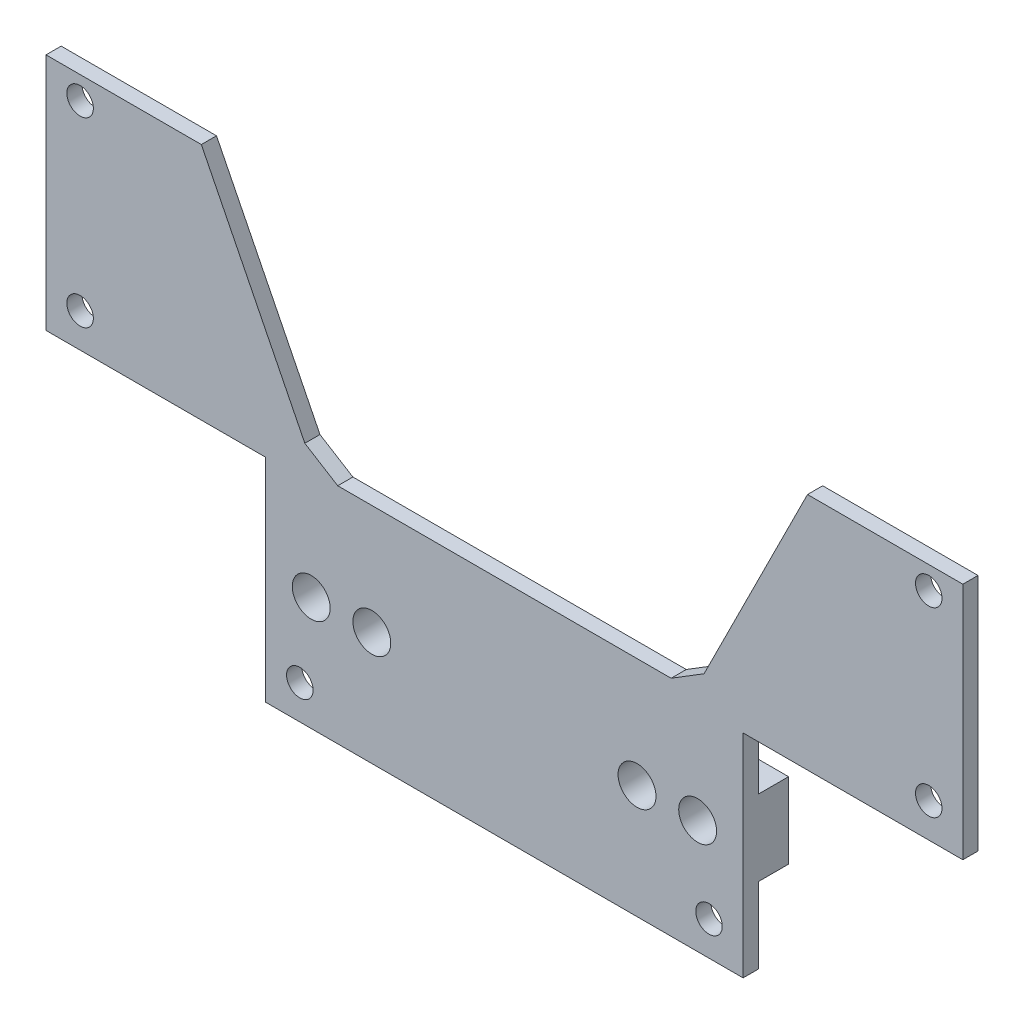
ISO-10303-21;
HEADER;
FILE_DESCRIPTION(('STEP AP214'),'2;1');
FILE_NAME('part.step','',(''),(''),'','','');
FILE_SCHEMA(('AUTOMOTIVE_DESIGN { 1 0 10303 214 1 1 1 1 }'));
ENDSEC;
DATA;
#1=APPLICATION_CONTEXT('core data for automotive mechanical design processes');
#2=APPLICATION_PROTOCOL_DEFINITION('international standard','automotive_design',2000,#1);
#3=PRODUCT_CONTEXT('',#1,'mechanical');
#4=PRODUCT('Part','Part','',(#3));
#5=PRODUCT_RELATED_PRODUCT_CATEGORY('part','',(#4));
#6=PRODUCT_DEFINITION_FORMATION('','',#4);
#7=PRODUCT_DEFINITION_CONTEXT('part definition',#1,'design');
#8=PRODUCT_DEFINITION('design','',#6,#7);
#9=PRODUCT_DEFINITION_SHAPE('','',#8);
#10=(LENGTH_UNIT() NAMED_UNIT(*) SI_UNIT(.MILLI.,.METRE.));
#11=(NAMED_UNIT(*) PLANE_ANGLE_UNIT() SI_UNIT($,.RADIAN.));
#12=(NAMED_UNIT(*) SI_UNIT($,.STERADIAN.) SOLID_ANGLE_UNIT());
#13=UNCERTAINTY_MEASURE_WITH_UNIT(LENGTH_MEASURE(1.E-05),#10,'distance_accuracy_value','');
#14=(GEOMETRIC_REPRESENTATION_CONTEXT(3) GLOBAL_UNCERTAINTY_ASSIGNED_CONTEXT((#13)) GLOBAL_UNIT_ASSIGNED_CONTEXT((#10,
#11,#12)) REPRESENTATION_CONTEXT('',''));
#15=CARTESIAN_POINT('',(0.,0.,0.));
#16=DIRECTION('',(0.,0.,1.));
#17=DIRECTION('',(1.,0.,0.));
#18=AXIS2_PLACEMENT_3D('',#15,#16,#17);
#19=CARTESIAN_POINT('',(60.5,59.5,1.99999999999995));
#20=DIRECTION('',(0.,-1.,0.));
#21=DIRECTION('',(0.,0.,-1.));
#22=AXIS2_PLACEMENT_3D('',#19,#20,#21);
#23=PLANE('',#22);
#24=DIRECTION('',(-1.,0.,0.));
#25=VECTOR('',#24,1.);
#26=CARTESIAN_POINT('',(60.5,59.5,-1.11022302462516E-13));
#27=LINE('',#26,#25);
#28=CARTESIAN_POINT('',(60.5,59.5,-1.11022302462516E-13));
#29=VERTEX_POINT('',#28);
#30=CARTESIAN_POINT('',(40.,59.5,-1.11022302462516E-13));
#31=VERTEX_POINT('',#30);
#32=EDGE_CURVE('E183',#29,#31,#27,.T.);
#33=ORIENTED_EDGE('',*,*,#32,.T.);
#34=DIRECTION('',(0.,0.,1.));
#35=VECTOR('',#34,1.);
#36=CARTESIAN_POINT('',(40.,59.5,-8.00000000000005));
#37=LINE('',#36,#35);
#38=CARTESIAN_POINT('',(40.,59.5,1.99999999999995));
#39=VERTEX_POINT('',#38);
#40=EDGE_CURVE('E166',#31,#39,#37,.T.);
#41=ORIENTED_EDGE('',*,*,#40,.T.);
#42=DIRECTION('',(-1.,0.,0.));
#43=VECTOR('',#42,1.);
#44=CARTESIAN_POINT('',(60.5,59.5,1.99999999999995));
#45=LINE('',#44,#43);
#46=CARTESIAN_POINT('',(60.5,59.5,1.99999999999995));
#47=VERTEX_POINT('',#46);
#48=EDGE_CURVE('E181',#47,#39,#45,.T.);
#49=ORIENTED_EDGE('',*,*,#48,.F.);
#50=DIRECTION('',(0.,0.,-1.));
#51=VECTOR('',#50,1.);
#52=CARTESIAN_POINT('',(60.5,59.5,1.99999999999995));
#53=LINE('',#52,#51);
#54=EDGE_CURVE('E212',#47,#29,#53,.T.);
#55=ORIENTED_EDGE('',*,*,#54,.T.);
#56=EDGE_LOOP('',(#33,#41,#49,#55));
#57=FACE_BOUND('',#56,.T.);
#58=ADVANCED_FACE('F39',(#57),#23,.F.);
#59=CARTESIAN_POINT('',(0.,0.,0.));
#60=DIRECTION('',(0.,0.,-1.));
#61=DIRECTION('',(-1.,0.,0.));
#62=AXIS2_PLACEMENT_3D('',#59,#60,#61);
#63=PLANE('',#62);
#64=CARTESIAN_POINT('',(27.,4.50000000000002,0.));
#65=DIRECTION('',(0.,0.,-1.));
#66=DIRECTION('',(-1.,0.,0.));
#67=AXIS2_PLACEMENT_3D('',#64,#65,#66);
#68=CIRCLE('',#67,1.75);
#69=CARTESIAN_POINT('',(25.25,4.50000000000002,0.));
#70=VERTEX_POINT('',#69);
#71=EDGE_CURVE('E308',#70,#70,#68,.T.);
#72=ORIENTED_EDGE('',*,*,#71,.F.);
#73=EDGE_LOOP('',(#72));
#74=FACE_BOUND('',#73,.T.);
#75=CARTESIAN_POINT('',(-27.,4.49999999999999,0.));
#76=DIRECTION('',(0.,0.,-1.));
#77=DIRECTION('',(-1.,0.,0.));
#78=AXIS2_PLACEMENT_3D('',#75,#76,#77);
#79=CIRCLE('',#78,1.75);
#80=CARTESIAN_POINT('',(-28.75,4.49999999999999,0.));
#81=VERTEX_POINT('',#80);
#82=EDGE_CURVE('E314',#81,#81,#79,.T.);
#83=ORIENTED_EDGE('',*,*,#82,.F.);
#84=EDGE_LOOP('',(#83));
#85=FACE_BOUND('',#84,.T.);
#86=DIRECTION('',(0.,-1.,0.));
#87=VECTOR('',#86,1.);
#88=CARTESIAN_POINT('',(-31.5,0.,0.));
#89=LINE('',#88,#87);
#90=CARTESIAN_POINT('',(-31.5,10.,0.));
#91=VERTEX_POINT('',#90);
#92=CARTESIAN_POINT('',(-31.5,0.,0.));
#93=VERTEX_POINT('',#92);
#94=EDGE_CURVE('E219',#91,#93,#89,.T.);
#95=ORIENTED_EDGE('',*,*,#94,.F.);
#96=DIRECTION('',(1.,0.,0.));
#97=VECTOR('',#96,1.);
#98=CARTESIAN_POINT('',(-31.5,10.,0.));
#99=LINE('',#98,#97);
#100=CARTESIAN_POINT('',(31.5,9.99999999999999,0.));
#101=VERTEX_POINT('',#100);
#102=EDGE_CURVE('E335',#91,#101,#99,.T.);
#103=ORIENTED_EDGE('',*,*,#102,.T.);
#104=DIRECTION('',(0.,1.,0.));
#105=VECTOR('',#104,1.);
#106=CARTESIAN_POINT('',(31.5,0.,0.));
#107=LINE('',#106,#105);
#108=CARTESIAN_POINT('',(31.5,0.,0.));
#109=VERTEX_POINT('',#108);
#110=EDGE_CURVE('E233',#109,#101,#107,.T.);
#111=ORIENTED_EDGE('',*,*,#110,.F.);
#112=DIRECTION('',(1.,0.,0.));
#113=VECTOR('',#112,1.);
#114=CARTESIAN_POINT('',(-31.5,0.,0.));
#115=LINE('',#114,#113);
#116=EDGE_CURVE('E222',#93,#109,#115,.T.);
#117=ORIENTED_EDGE('',*,*,#116,.F.);
#118=EDGE_LOOP('',(#95,#103,#111,#117));
#119=FACE_BOUND('',#118,.T.);
#120=ADVANCED_FACE('F432',(#74,#85,#119),#63,.T.);
#121=DIRECTION('',(-0.447213595499958,-0.894427190999916,0.));
#122=VECTOR('',#121,1.);
#123=CARTESIAN_POINT('',(8.20000000000001,-4.1,0.));
#124=LINE('',#123,#122);
#125=CARTESIAN_POINT('',(26.3416407864999,32.1832815729997,0.));
#126=VERTEX_POINT('',#125);
#127=EDGE_CURVE('E386',#31,#126,#124,.T.);
#128=ORIENTED_EDGE('',*,*,#127,.F.);
#129=ORIENTED_EDGE('',*,*,#32,.F.);
#130=DIRECTION('',(0.,1.,0.));
#131=VECTOR('',#130,1.);
#132=CARTESIAN_POINT('',(60.5,28.,0.));
#133=LINE('',#132,#131);
#134=CARTESIAN_POINT('',(60.5,28.,0.));
#135=VERTEX_POINT('',#134);
#136=EDGE_CURVE('E197',#135,#29,#133,.T.);
#137=ORIENTED_EDGE('',*,*,#136,.F.);
#138=DIRECTION('',(1.,0.,0.));
#139=VECTOR('',#138,1.);
#140=CARTESIAN_POINT('',(31.5,28.,0.));
#141=LINE('',#140,#139);
#142=CARTESIAN_POINT('',(31.5,28.,0.));
#143=VERTEX_POINT('',#142);
#144=EDGE_CURVE('E236',#143,#135,#141,.T.);
#145=ORIENTED_EDGE('',*,*,#144,.F.);
#146=CARTESIAN_POINT('',(31.5,20.,0.));
#147=VERTEX_POINT('',#146);
#148=EDGE_CURVE('E231',#147,#143,#107,.T.);
#149=ORIENTED_EDGE('',*,*,#148,.F.);
#150=DIRECTION('',(-1.,0.,0.));
#151=VECTOR('',#150,1.);
#152=CARTESIAN_POINT('',(-31.5,20.,0.));
#153=LINE('',#152,#151);
#154=CARTESIAN_POINT('',(-31.5,20.,0.));
#155=VERTEX_POINT('',#154);
#156=EDGE_CURVE('E274',#147,#155,#153,.T.);
#157=ORIENTED_EDGE('',*,*,#156,.T.);
#158=CARTESIAN_POINT('',(-31.5,28.,0.));
#159=VERTEX_POINT('',#158);
#160=EDGE_CURVE('E228',#159,#155,#89,.T.);
#161=ORIENTED_EDGE('',*,*,#160,.F.);
#162=DIRECTION('',(1.,0.,0.));
#163=VECTOR('',#162,1.);
#164=CARTESIAN_POINT('',(-31.5,28.,0.));
#165=LINE('',#164,#163);
#166=CARTESIAN_POINT('',(-60.5,28.,0.));
#167=VERTEX_POINT('',#166);
#168=EDGE_CURVE('E217',#167,#159,#165,.T.);
#169=ORIENTED_EDGE('',*,*,#168,.F.);
#170=DIRECTION('',(0.,-1.,0.));
#171=VECTOR('',#170,1.);
#172=CARTESIAN_POINT('',(-60.5,28.,0.));
#173=LINE('',#172,#171);
#174=CARTESIAN_POINT('',(-60.5,59.5,0.));
#175=VERTEX_POINT('',#174);
#176=EDGE_CURVE('E214',#175,#167,#173,.T.);
#177=ORIENTED_EDGE('',*,*,#176,.F.);
#178=CARTESIAN_POINT('',(-40.,59.5,-1.11022302462516E-13));
#179=VERTEX_POINT('',#178);
#180=EDGE_CURVE('E215',#179,#175,#27,.T.);
#181=ORIENTED_EDGE('',*,*,#180,.F.);
#182=DIRECTION('',(-0.447213595499958,0.894427190999916,0.));
#183=VECTOR('',#182,1.);
#184=CARTESIAN_POINT('',(-8.20000000000001,-4.1,0.));
#185=LINE('',#184,#183);
#186=CARTESIAN_POINT('',(-26.3416407864999,32.1832815729997,0.));
#187=VERTEX_POINT('',#186);
#188=EDGE_CURVE('E389',#187,#179,#185,.T.);
#189=ORIENTED_EDGE('',*,*,#188,.F.);
#190=DIRECTION('',(0.850650808352042,-0.52573111211913,0.));
#191=VECTOR('',#190,1.);
#192=CARTESIAN_POINT('',(-26.3416407864999,32.1832815729997,0.));
#193=LINE('',#192,#191);
#194=CARTESIAN_POINT('',(-22.,29.5,0.));
#195=VERTEX_POINT('',#194);
#196=EDGE_CURVE('E404',#187,#195,#193,.T.);
#197=ORIENTED_EDGE('',*,*,#196,.T.);
#198=DIRECTION('',(-1.,0.,0.));
#199=VECTOR('',#198,1.);
#200=CARTESIAN_POINT('',(0.,29.5,0.));
#201=LINE('',#200,#199);
#202=CARTESIAN_POINT('',(22.,29.5,0.));
#203=VERTEX_POINT('',#202);
#204=EDGE_CURVE('E56',#203,#195,#201,.T.);
#205=ORIENTED_EDGE('',*,*,#204,.F.);
#206=DIRECTION('',(0.850650808352041,0.525731112119132,0.));
#207=VECTOR('',#206,1.);
#208=CARTESIAN_POINT('',(26.3416407864999,32.1832815729997,0.));
#209=LINE('',#208,#207);
#210=EDGE_CURVE('E397',#203,#126,#209,.T.);
#211=ORIENTED_EDGE('',*,*,#210,.T.);
#212=EDGE_LOOP('',(#128,#129,#137,#145,#149,#157,#161,#169,#177,#181,#189,#197,#205,#211));
#213=FACE_BOUND('',#212,.T.);
#214=CARTESIAN_POINT('',(56.,56.5,0.));
#215=DIRECTION('',(0.,0.,-1.));
#216=DIRECTION('',(-1.,0.,0.));
#217=AXIS2_PLACEMENT_3D('',#214,#215,#216);
#218=CIRCLE('',#217,1.75);
#219=CARTESIAN_POINT('',(54.25,56.5,0.));
#220=VERTEX_POINT('',#219);
#221=EDGE_CURVE('E292',#220,#220,#218,.T.);
#222=ORIENTED_EDGE('',*,*,#221,.F.);
#223=EDGE_LOOP('',(#222));
#224=FACE_BOUND('',#223,.T.);
#225=CARTESIAN_POINT('',(56.,32.5,0.));
#226=DIRECTION('',(0.,0.,-1.));
#227=DIRECTION('',(-1.,0.,0.));
#228=AXIS2_PLACEMENT_3D('',#225,#226,#227);
#229=CIRCLE('',#228,1.75);
#230=CARTESIAN_POINT('',(54.25,32.5,0.));
#231=VERTEX_POINT('',#230);
#232=EDGE_CURVE('E300',#231,#231,#229,.T.);
#233=ORIENTED_EDGE('',*,*,#232,.F.);
#234=EDGE_LOOP('',(#233));
#235=FACE_BOUND('',#234,.T.);
#236=CARTESIAN_POINT('',(-56.,32.5,0.));
#237=DIRECTION('',(0.,0.,-1.));
#238=DIRECTION('',(-1.,0.,0.));
#239=AXIS2_PLACEMENT_3D('',#236,#237,#238);
#240=CIRCLE('',#239,1.75);
#241=CARTESIAN_POINT('',(-57.75,32.5,0.));
#242=VERTEX_POINT('',#241);
#243=EDGE_CURVE('E320',#242,#242,#240,.T.);
#244=ORIENTED_EDGE('',*,*,#243,.F.);
#245=EDGE_LOOP('',(#244));
#246=FACE_BOUND('',#245,.T.);
#247=CARTESIAN_POINT('',(-56.,56.5,0.));
#248=DIRECTION('',(0.,0.,-1.));
#249=DIRECTION('',(-1.,0.,0.));
#250=AXIS2_PLACEMENT_3D('',#247,#248,#249);
#251=CIRCLE('',#250,1.75);
#252=CARTESIAN_POINT('',(-57.75,56.5,0.));
#253=VERTEX_POINT('',#252);
#254=EDGE_CURVE('E326',#253,#253,#251,.T.);
#255=ORIENTED_EDGE('',*,*,#254,.F.);
#256=EDGE_LOOP('',(#255));
#257=FACE_BOUND('',#256,.T.);
#258=ADVANCED_FACE('F268',(#213,#224,#235,#246,#257),#63,.T.);
#259=CARTESIAN_POINT('',(-40.0000000000001,59.5,1.99999999999995));
#260=VERTEX_POINT('',#259);
#261=CARTESIAN_POINT('',(-60.5,59.5,1.99999999999995));
#262=VERTEX_POINT('',#261);
#263=EDGE_CURVE('E193',#260,#262,#45,.T.);
#264=ORIENTED_EDGE('',*,*,#263,.F.);
#265=DIRECTION('',(0.,0.,1.));
#266=VECTOR('',#265,1.);
#267=CARTESIAN_POINT('',(-40.,59.5,-8.00000000000005));
#268=LINE('',#267,#266);
#269=EDGE_CURVE('E184',#179,#260,#268,.T.);
#270=ORIENTED_EDGE('',*,*,#269,.F.);
#271=ORIENTED_EDGE('',*,*,#180,.T.);
#272=DIRECTION('',(0.,0.,-1.));
#273=VECTOR('',#272,1.);
#274=CARTESIAN_POINT('',(-60.5,59.5,1.99999999999995));
#275=LINE('',#274,#273);
#276=EDGE_CURVE('E11',#262,#175,#275,.T.);
#277=ORIENTED_EDGE('',*,*,#276,.F.);
#278=EDGE_LOOP('',(#264,#270,#271,#277));
#279=FACE_BOUND('',#278,.T.);
#280=ADVANCED_FACE('F41',(#279),#23,.F.);
#281=CARTESIAN_POINT('',(-60.5,28.,1.99999999999995));
#282=DIRECTION('',(1.,0.,0.));
#283=DIRECTION('',(0.,0.,-1.));
#284=AXIS2_PLACEMENT_3D('',#281,#282,#283);
#285=PLANE('',#284);
#286=ORIENTED_EDGE('',*,*,#176,.T.);
#287=DIRECTION('',(0.,0.,-1.));
#288=VECTOR('',#287,1.);
#289=CARTESIAN_POINT('',(-60.5,28.,1.99999999999995));
#290=LINE('',#289,#288);
#291=CARTESIAN_POINT('',(-60.5,28.,1.99999999999995));
#292=VERTEX_POINT('',#291);
#293=EDGE_CURVE('E48',#292,#167,#290,.T.);
#294=ORIENTED_EDGE('',*,*,#293,.F.);
#295=DIRECTION('',(0.,-1.,0.));
#296=VECTOR('',#295,1.);
#297=CARTESIAN_POINT('',(-60.5,28.,1.99999999999995));
#298=LINE('',#297,#296);
#299=EDGE_CURVE('E192',#262,#292,#298,.T.);
#300=ORIENTED_EDGE('',*,*,#299,.F.);
#301=ORIENTED_EDGE('',*,*,#276,.T.);
#302=EDGE_LOOP('',(#286,#294,#300,#301));
#303=FACE_BOUND('',#302,.T.);
#304=ADVANCED_FACE('F287',(#303),#285,.F.);
#305=CARTESIAN_POINT('',(-31.5,28.,2.));
#306=DIRECTION('',(0.,1.,0.));
#307=DIRECTION('',(0.,0.,1.));
#308=AXIS2_PLACEMENT_3D('',#305,#306,#307);
#309=PLANE('',#308);
#310=ORIENTED_EDGE('',*,*,#168,.T.);
#311=DIRECTION('',(0.,0.,-1.));
#312=VECTOR('',#311,1.);
#313=CARTESIAN_POINT('',(-31.5,28.,2.));
#314=LINE('',#313,#312);
#315=CARTESIAN_POINT('',(-31.5,28.,2.));
#316=VERTEX_POINT('',#315);
#317=EDGE_CURVE('E253',#316,#159,#314,.T.);
#318=ORIENTED_EDGE('',*,*,#317,.F.);
#319=DIRECTION('',(1.,0.,0.));
#320=VECTOR('',#319,1.);
#321=CARTESIAN_POINT('',(-31.5,28.,2.));
#322=LINE('',#321,#320);
#323=EDGE_CURVE('E195',#292,#316,#322,.T.);
#324=ORIENTED_EDGE('',*,*,#323,.F.);
#325=ORIENTED_EDGE('',*,*,#293,.T.);
#326=EDGE_LOOP('',(#310,#318,#324,#325));
#327=FACE_BOUND('',#326,.T.);
#328=ADVANCED_FACE('F261',(#327),#309,.F.);
#329=CARTESIAN_POINT('',(-31.5,0.,1.99999999999995));
#330=DIRECTION('',(1.,0.,0.));
#331=DIRECTION('',(0.,0.,-1.));
#332=AXIS2_PLACEMENT_3D('',#329,#330,#331);
#333=PLANE('',#332);
#334=ORIENTED_EDGE('',*,*,#160,.T.);
#335=DIRECTION('',(0.,0.,1.));
#336=VECTOR('',#335,1.);
#337=CARTESIAN_POINT('',(-31.5,20.,-4.));
#338=LINE('',#337,#336);
#339=CARTESIAN_POINT('',(-31.5,20.,-4.));
#340=VERTEX_POINT('',#339);
#341=EDGE_CURVE('E278',#340,#155,#338,.T.);
#342=ORIENTED_EDGE('',*,*,#341,.F.);
#343=DIRECTION('',(0.,-1.,0.));
#344=VECTOR('',#343,1.);
#345=CARTESIAN_POINT('',(-31.5,20.,-4.));
#346=LINE('',#345,#344);
#347=CARTESIAN_POINT('',(-31.5,10.,-4.));
#348=VERTEX_POINT('',#347);
#349=EDGE_CURVE('E334',#340,#348,#346,.T.);
#350=ORIENTED_EDGE('',*,*,#349,.T.);
#351=DIRECTION('',(0.,0.,1.));
#352=VECTOR('',#351,1.);
#353=CARTESIAN_POINT('',(-31.5,10.,-4.));
#354=LINE('',#353,#352);
#355=EDGE_CURVE('E345',#348,#91,#354,.T.);
#356=ORIENTED_EDGE('',*,*,#355,.T.);
#357=ORIENTED_EDGE('',*,*,#94,.T.);
#358=DIRECTION('',(0.,0.,-1.));
#359=VECTOR('',#358,1.);
#360=CARTESIAN_POINT('',(-31.5,0.,1.99999999999995));
#361=LINE('',#360,#359);
#362=CARTESIAN_POINT('',(-31.5,0.,1.99999999999995));
#363=VERTEX_POINT('',#362);
#364=EDGE_CURVE('E250',#363,#93,#361,.T.);
#365=ORIENTED_EDGE('',*,*,#364,.F.);
#366=DIRECTION('',(0.,-1.,0.));
#367=VECTOR('',#366,1.);
#368=CARTESIAN_POINT('',(-31.5,0.,1.99999999999995));
#369=LINE('',#368,#367);
#370=EDGE_CURVE('E203',#316,#363,#369,.T.);
#371=ORIENTED_EDGE('',*,*,#370,.F.);
#372=ORIENTED_EDGE('',*,*,#317,.T.);
#373=EDGE_LOOP('',(#334,#342,#350,#356,#357,#365,#371,#372));
#374=FACE_BOUND('',#373,.T.);
#375=ADVANCED_FACE('F276',(#374),#333,.F.);
#376=CARTESIAN_POINT('',(-31.5,0.,1.99999999999995));
#377=DIRECTION('',(0.,1.,0.));
#378=DIRECTION('',(0.,0.,1.));
#379=AXIS2_PLACEMENT_3D('',#376,#377,#378);
#380=PLANE('',#379);
#381=ORIENTED_EDGE('',*,*,#116,.T.);
#382=DIRECTION('',(0.,0.,-1.));
#383=VECTOR('',#382,1.);
#384=CARTESIAN_POINT('',(31.5,0.,1.99999999999995));
#385=LINE('',#384,#383);
#386=CARTESIAN_POINT('',(31.5,0.,1.99999999999995));
#387=VERTEX_POINT('',#386);
#388=EDGE_CURVE('E247',#387,#109,#385,.T.);
#389=ORIENTED_EDGE('',*,*,#388,.F.);
#390=DIRECTION('',(1.,0.,0.));
#391=VECTOR('',#390,1.);
#392=CARTESIAN_POINT('',(-31.5,0.,1.99999999999995));
#393=LINE('',#392,#391);
#394=EDGE_CURVE('E205',#363,#387,#393,.T.);
#395=ORIENTED_EDGE('',*,*,#394,.F.);
#396=ORIENTED_EDGE('',*,*,#364,.T.);
#397=EDGE_LOOP('',(#381,#389,#395,#396));
#398=FACE_BOUND('',#397,.T.);
#399=ADVANCED_FACE('F459',(#398),#380,.F.);
#400=CARTESIAN_POINT('',(31.5,0.,1.99999999999995));
#401=DIRECTION('',(-1.,0.,0.));
#402=DIRECTION('',(0.,0.,1.));
#403=AXIS2_PLACEMENT_3D('',#400,#401,#402);
#404=PLANE('',#403);
#405=ORIENTED_EDGE('',*,*,#110,.T.);
#406=DIRECTION('',(0.,0.,1.));
#407=VECTOR('',#406,1.);
#408=CARTESIAN_POINT('',(31.5,9.99999999999999,-4.00000000000006));
#409=LINE('',#408,#407);
#410=CARTESIAN_POINT('',(31.5,9.99999999999999,-4.00000000000006));
#411=VERTEX_POINT('',#410);
#412=EDGE_CURVE('E341',#411,#101,#409,.T.);
#413=ORIENTED_EDGE('',*,*,#412,.F.);
#414=DIRECTION('',(0.,1.,0.));
#415=VECTOR('',#414,1.);
#416=CARTESIAN_POINT('',(31.5,20.,-4.00000000000011));
#417=LINE('',#416,#415);
#418=CARTESIAN_POINT('',(31.5,20.,-4.00000000000011));
#419=VERTEX_POINT('',#418);
#420=EDGE_CURVE('E353',#411,#419,#417,.T.);
#421=ORIENTED_EDGE('',*,*,#420,.T.);
#422=DIRECTION('',(0.,0.,1.));
#423=VECTOR('',#422,1.);
#424=CARTESIAN_POINT('',(31.5,20.,-4.00000000000011));
#425=LINE('',#424,#423);
#426=EDGE_CURVE('E337',#419,#147,#425,.T.);
#427=ORIENTED_EDGE('',*,*,#426,.T.);
#428=ORIENTED_EDGE('',*,*,#148,.T.);
#429=DIRECTION('',(0.,0.,-1.));
#430=VECTOR('',#429,1.);
#431=CARTESIAN_POINT('',(31.5,28.,2.));
#432=LINE('',#431,#430);
#433=CARTESIAN_POINT('',(31.5,28.,2.));
#434=VERTEX_POINT('',#433);
#435=EDGE_CURVE('E244',#434,#143,#432,.T.);
#436=ORIENTED_EDGE('',*,*,#435,.F.);
#437=DIRECTION('',(0.,1.,0.));
#438=VECTOR('',#437,1.);
#439=CARTESIAN_POINT('',(31.5,0.,1.99999999999995));
#440=LINE('',#439,#438);
#441=EDGE_CURVE('E207',#387,#434,#440,.T.);
#442=ORIENTED_EDGE('',*,*,#441,.F.);
#443=ORIENTED_EDGE('',*,*,#388,.T.);
#444=EDGE_LOOP('',(#405,#413,#421,#427,#428,#436,#442,#443));
#445=FACE_BOUND('',#444,.T.);
#446=ADVANCED_FACE('F455',(#445),#404,.F.);
#447=CARTESIAN_POINT('',(31.5,28.,2.));
#448=DIRECTION('',(0.,1.,0.));
#449=DIRECTION('',(0.,0.,1.));
#450=AXIS2_PLACEMENT_3D('',#447,#448,#449);
#451=PLANE('',#450);
#452=ORIENTED_EDGE('',*,*,#144,.T.);
#453=DIRECTION('',(0.,0.,-1.));
#454=VECTOR('',#453,1.);
#455=CARTESIAN_POINT('',(60.5,28.,1.99999999999989));
#456=LINE('',#455,#454);
#457=CARTESIAN_POINT('',(60.5,28.,1.99999999999989));
#458=VERTEX_POINT('',#457);
#459=EDGE_CURVE('E241',#458,#135,#456,.T.);
#460=ORIENTED_EDGE('',*,*,#459,.F.);
#461=DIRECTION('',(1.,0.,0.));
#462=VECTOR('',#461,1.);
#463=CARTESIAN_POINT('',(31.5,28.,2.));
#464=LINE('',#463,#462);
#465=EDGE_CURVE('E209',#434,#458,#464,.T.);
#466=ORIENTED_EDGE('',*,*,#465,.F.);
#467=ORIENTED_EDGE('',*,*,#435,.T.);
#468=EDGE_LOOP('',(#452,#460,#466,#467));
#469=FACE_BOUND('',#468,.T.);
#470=ADVANCED_FACE('F451',(#469),#451,.F.);
#471=CARTESIAN_POINT('',(60.5,28.,1.99999999999989));
#472=DIRECTION('',(-1.,0.,0.));
#473=DIRECTION('',(0.,0.,1.));
#474=AXIS2_PLACEMENT_3D('',#471,#472,#473);
#475=PLANE('',#474);
#476=ORIENTED_EDGE('',*,*,#136,.T.);
#477=ORIENTED_EDGE('',*,*,#54,.F.);
#478=DIRECTION('',(0.,1.,0.));
#479=VECTOR('',#478,1.);
#480=CARTESIAN_POINT('',(60.5,28.,1.99999999999989));
#481=LINE('',#480,#479);
#482=EDGE_CURVE('E190',#458,#47,#481,.T.);
#483=ORIENTED_EDGE('',*,*,#482,.F.);
#484=ORIENTED_EDGE('',*,*,#459,.T.);
#485=EDGE_LOOP('',(#476,#477,#483,#484));
#486=FACE_BOUND('',#485,.T.);
#487=ADVANCED_FACE('F448',(#486),#475,.F.);
#488=CARTESIAN_POINT('',(0.,0.,1.99999999999995));
#489=DIRECTION('',(0.,0.,-1.));
#490=DIRECTION('',(-1.,0.,0.));
#491=AXIS2_PLACEMENT_3D('',#488,#489,#490);
#492=PLANE('',#491);
#493=DIRECTION('',(1.,0.,0.));
#494=VECTOR('',#493,1.);
#495=CARTESIAN_POINT('',(25.,29.5,1.99999999999995));
#496=LINE('',#495,#494);
#497=CARTESIAN_POINT('',(-22.,29.5,1.99999999999995));
#498=VERTEX_POINT('',#497);
#499=CARTESIAN_POINT('',(22.,29.5,1.99999999999995));
#500=VERTEX_POINT('',#499);
#501=EDGE_CURVE('E185',#498,#500,#496,.T.);
#502=ORIENTED_EDGE('',*,*,#501,.F.);
#503=DIRECTION('',(-0.850650808352042,0.52573111211913,0.));
#504=VECTOR('',#503,1.);
#505=CARTESIAN_POINT('',(-26.3416407864999,32.1832815729997,1.99999999999995));
#506=LINE('',#505,#504);
#507=CARTESIAN_POINT('',(-26.3416407864999,32.1832815729997,1.99999999999995));
#508=VERTEX_POINT('',#507);
#509=EDGE_CURVE('E401',#498,#508,#506,.T.);
#510=ORIENTED_EDGE('',*,*,#509,.T.);
#511=DIRECTION('',(0.447213595499958,-0.894427190999916,0.));
#512=VECTOR('',#511,1.);
#513=CARTESIAN_POINT('',(-40.,59.5,1.99999999999995));
#514=LINE('',#513,#512);
#515=EDGE_CURVE('E174',#260,#508,#514,.T.);
#516=ORIENTED_EDGE('',*,*,#515,.F.);
#517=ORIENTED_EDGE('',*,*,#263,.T.);
#518=ORIENTED_EDGE('',*,*,#299,.T.);
#519=ORIENTED_EDGE('',*,*,#323,.T.);
#520=ORIENTED_EDGE('',*,*,#370,.T.);
#521=ORIENTED_EDGE('',*,*,#394,.T.);
#522=ORIENTED_EDGE('',*,*,#441,.T.);
#523=ORIENTED_EDGE('',*,*,#465,.T.);
#524=ORIENTED_EDGE('',*,*,#482,.T.);
#525=ORIENTED_EDGE('',*,*,#48,.T.);
#526=DIRECTION('',(0.447213595499958,0.894427190999916,0.));
#527=VECTOR('',#526,1.);
#528=CARTESIAN_POINT('',(40.,59.5,1.99999999999995));
#529=LINE('',#528,#527);
#530=CARTESIAN_POINT('',(26.3416407864999,32.1832815729997,1.99999999999995));
#531=VERTEX_POINT('',#530);
#532=EDGE_CURVE('E163',#531,#39,#529,.T.);
#533=ORIENTED_EDGE('',*,*,#532,.F.);
#534=DIRECTION('',(-0.850650808352041,-0.525731112119132,0.));
#535=VECTOR('',#534,1.);
#536=CARTESIAN_POINT('',(26.3416407864999,32.1832815729997,1.99999999999995));
#537=LINE('',#536,#535);
#538=EDGE_CURVE('E175',#531,#500,#537,.T.);
#539=ORIENTED_EDGE('',*,*,#538,.T.);
#540=EDGE_LOOP('',(#502,#510,#516,#517,#518,#519,#520,#521,#522,#523,#524,#525,#533,#539));
#541=FACE_BOUND('',#540,.T.);
#542=CARTESIAN_POINT('',(17.5,15.,1.99999999999995));
#543=DIRECTION('',(0.,0.,-1.));
#544=DIRECTION('',(-1.,0.,0.));
#545=AXIS2_PLACEMENT_3D('',#542,#543,#544);
#546=CIRCLE('',#545,2.5);
#547=CARTESIAN_POINT('',(15.,15.,1.99999999999995));
#548=VERTEX_POINT('',#547);
#549=EDGE_CURVE('E380',#548,#548,#546,.T.);
#550=ORIENTED_EDGE('',*,*,#549,.T.);
#551=EDGE_LOOP('',(#550));
#552=FACE_BOUND('',#551,.T.);
#553=CARTESIAN_POINT('',(25.5,15.,1.99999999999995));
#554=DIRECTION('',(0.,0.,-1.));
#555=DIRECTION('',(-1.,0.,0.));
#556=AXIS2_PLACEMENT_3D('',#553,#554,#555);
#557=CIRCLE('',#556,2.5);
#558=CARTESIAN_POINT('',(23.,15.,1.99999999999995));
#559=VERTEX_POINT('',#558);
#560=EDGE_CURVE('E374',#559,#559,#557,.T.);
#561=ORIENTED_EDGE('',*,*,#560,.T.);
#562=EDGE_LOOP('',(#561));
#563=FACE_BOUND('',#562,.T.);
#564=CARTESIAN_POINT('',(-25.5,15.,1.99999999999995));
#565=DIRECTION('',(0.,0.,-1.));
#566=DIRECTION('',(-1.,0.,0.));
#567=AXIS2_PLACEMENT_3D('',#564,#565,#566);
#568=CIRCLE('',#567,2.5);
#569=CARTESIAN_POINT('',(-28.,15.,1.99999999999995));
#570=VERTEX_POINT('',#569);
#571=EDGE_CURVE('E368',#570,#570,#568,.T.);
#572=ORIENTED_EDGE('',*,*,#571,.T.);
#573=EDGE_LOOP('',(#572));
#574=FACE_BOUND('',#573,.T.);
#575=CARTESIAN_POINT('',(-17.5,15.,1.99999999999989));
#576=DIRECTION('',(0.,0.,-1.));
#577=DIRECTION('',(-1.,0.,0.));
#578=AXIS2_PLACEMENT_3D('',#575,#576,#577);
#579=CIRCLE('',#578,2.5);
#580=CARTESIAN_POINT('',(-20.,15.,1.99999999999989));
#581=VERTEX_POINT('',#580);
#582=EDGE_CURVE('E349',#581,#581,#579,.T.);
#583=ORIENTED_EDGE('',*,*,#582,.T.);
#584=EDGE_LOOP('',(#583));
#585=FACE_BOUND('',#584,.T.);
#586=CARTESIAN_POINT('',(-56.,56.5,1.99999999999995));
#587=DIRECTION('',(0.,0.,-1.));
#588=DIRECTION('',(-1.,0.,0.));
#589=AXIS2_PLACEMENT_3D('',#586,#587,#588);
#590=CIRCLE('',#589,1.75);
#591=CARTESIAN_POINT('',(-57.75,56.5,1.99999999999995));
#592=VERTEX_POINT('',#591);
#593=EDGE_CURVE('E323',#592,#592,#590,.T.);
#594=ORIENTED_EDGE('',*,*,#593,.T.);
#595=EDGE_LOOP('',(#594));
#596=FACE_BOUND('',#595,.T.);
#597=CARTESIAN_POINT('',(-56.,32.5,1.99999999999995));
#598=DIRECTION('',(0.,0.,-1.));
#599=DIRECTION('',(-1.,0.,0.));
#600=AXIS2_PLACEMENT_3D('',#597,#598,#599);
#601=CIRCLE('',#600,1.75);
#602=CARTESIAN_POINT('',(-57.75,32.5,1.99999999999995));
#603=VERTEX_POINT('',#602);
#604=EDGE_CURVE('E317',#603,#603,#601,.T.);
#605=ORIENTED_EDGE('',*,*,#604,.T.);
#606=EDGE_LOOP('',(#605));
#607=FACE_BOUND('',#606,.T.);
#608=CARTESIAN_POINT('',(-27.,4.49999999999999,2.));
#609=DIRECTION('',(0.,0.,-1.));
#610=DIRECTION('',(-1.,0.,0.));
#611=AXIS2_PLACEMENT_3D('',#608,#609,#610);
#612=CIRCLE('',#611,1.75);
#613=CARTESIAN_POINT('',(-28.75,4.49999999999999,2.));
#614=VERTEX_POINT('',#613);
#615=EDGE_CURVE('E311',#614,#614,#612,.T.);
#616=ORIENTED_EDGE('',*,*,#615,.T.);
#617=EDGE_LOOP('',(#616));
#618=FACE_BOUND('',#617,.T.);
#619=CARTESIAN_POINT('',(27.,4.49999999999998,1.99999999999995));
#620=DIRECTION('',(0.,0.,-1.));
#621=DIRECTION('',(-1.,0.,0.));
#622=AXIS2_PLACEMENT_3D('',#619,#620,#621);
#623=CIRCLE('',#622,1.75);
#624=CARTESIAN_POINT('',(25.25,4.49999999999998,1.99999999999995));
#625=VERTEX_POINT('',#624);
#626=EDGE_CURVE('E305',#625,#625,#623,.T.);
#627=ORIENTED_EDGE('',*,*,#626,.T.);
#628=EDGE_LOOP('',(#627));
#629=FACE_BOUND('',#628,.T.);
#630=CARTESIAN_POINT('',(56.,32.5,1.99999999999995));
#631=DIRECTION('',(0.,0.,-1.));
#632=DIRECTION('',(-1.,0.,0.));
#633=AXIS2_PLACEMENT_3D('',#630,#631,#632);
#634=CIRCLE('',#633,1.75);
#635=CARTESIAN_POINT('',(54.25,32.5,1.99999999999995));
#636=VERTEX_POINT('',#635);
#637=EDGE_CURVE('E296',#636,#636,#634,.T.);
#638=ORIENTED_EDGE('',*,*,#637,.T.);
#639=EDGE_LOOP('',(#638));
#640=FACE_BOUND('',#639,.T.);
#641=CARTESIAN_POINT('',(56.,56.5,1.99999999999995));
#642=DIRECTION('',(0.,0.,-1.));
#643=DIRECTION('',(-1.,0.,0.));
#644=AXIS2_PLACEMENT_3D('',#641,#642,#643);
#645=CIRCLE('',#644,1.75);
#646=CARTESIAN_POINT('',(54.25,56.5,1.99999999999995));
#647=VERTEX_POINT('',#646);
#648=EDGE_CURVE('E199',#647,#647,#645,.T.);
#649=ORIENTED_EDGE('',*,*,#648,.T.);
#650=EDGE_LOOP('',(#649));
#651=FACE_BOUND('',#650,.T.);
#652=ADVANCED_FACE('F187',(#541,#552,#563,#574,#585,#596,#607,#618,#629,#640,#651),#492,.F.);
#653=CARTESIAN_POINT('',(56.,56.5,9.99999999999995));
#654=DIRECTION('',(0.,0.,-1.));
#655=DIRECTION('',(-1.,0.,0.));
#656=AXIS2_PLACEMENT_3D('',#653,#654,#655);
#657=CYLINDRICAL_SURFACE('',#656,1.75);
#658=ORIENTED_EDGE('',*,*,#221,.T.);
#659=EDGE_LOOP('',(#658));
#660=FACE_BOUND('',#659,.T.);
#661=ORIENTED_EDGE('',*,*,#648,.F.);
#662=EDGE_LOOP('',(#661));
#663=FACE_BOUND('',#662,.T.);
#664=ADVANCED_FACE('F498',(#660,#663),#657,.F.);
#665=CARTESIAN_POINT('',(56.,32.5,9.99999999999995));
#666=DIRECTION('',(0.,0.,-1.));
#667=DIRECTION('',(-1.,0.,0.));
#668=AXIS2_PLACEMENT_3D('',#665,#666,#667);
#669=CYLINDRICAL_SURFACE('',#668,1.75);
#670=ORIENTED_EDGE('',*,*,#232,.T.);
#671=EDGE_LOOP('',(#670));
#672=FACE_BOUND('',#671,.T.);
#673=ORIENTED_EDGE('',*,*,#637,.F.);
#674=EDGE_LOOP('',(#673));
#675=FACE_BOUND('',#674,.T.);
#676=ADVANCED_FACE('F504',(#672,#675),#669,.F.);
#677=CARTESIAN_POINT('',(27.,4.49999999999999,9.99999999999995));
#678=DIRECTION('',(0.,0.,-1.));
#679=DIRECTION('',(-1.,0.,0.));
#680=AXIS2_PLACEMENT_3D('',#677,#678,#679);
#681=CYLINDRICAL_SURFACE('',#680,1.75);
#682=ORIENTED_EDGE('',*,*,#71,.T.);
#683=EDGE_LOOP('',(#682));
#684=FACE_BOUND('',#683,.T.);
#685=ORIENTED_EDGE('',*,*,#626,.F.);
#686=EDGE_LOOP('',(#685));
#687=FACE_BOUND('',#686,.T.);
#688=ADVANCED_FACE('F510',(#684,#687),#681,.F.);
#689=CARTESIAN_POINT('',(-27.,4.5,10.));
#690=DIRECTION('',(0.,0.,-1.));
#691=DIRECTION('',(-1.,0.,0.));
#692=AXIS2_PLACEMENT_3D('',#689,#690,#691);
#693=CYLINDRICAL_SURFACE('',#692,1.75);
#694=ORIENTED_EDGE('',*,*,#82,.T.);
#695=EDGE_LOOP('',(#694));
#696=FACE_BOUND('',#695,.T.);
#697=ORIENTED_EDGE('',*,*,#615,.F.);
#698=EDGE_LOOP('',(#697));
#699=FACE_BOUND('',#698,.T.);
#700=ADVANCED_FACE('F518',(#696,#699),#693,.F.);
#701=CARTESIAN_POINT('',(-56.,32.5,9.99999999999995));
#702=DIRECTION('',(0.,0.,-1.));
#703=DIRECTION('',(-1.,0.,0.));
#704=AXIS2_PLACEMENT_3D('',#701,#702,#703);
#705=CYLINDRICAL_SURFACE('',#704,1.75);
#706=ORIENTED_EDGE('',*,*,#243,.T.);
#707=EDGE_LOOP('',(#706));
#708=FACE_BOUND('',#707,.T.);
#709=ORIENTED_EDGE('',*,*,#604,.F.);
#710=EDGE_LOOP('',(#709));
#711=FACE_BOUND('',#710,.T.);
#712=ADVANCED_FACE('F526',(#708,#711),#705,.F.);
#713=CARTESIAN_POINT('',(-56.,56.5,9.99999999999995));
#714=DIRECTION('',(0.,0.,-1.));
#715=DIRECTION('',(-1.,0.,0.));
#716=AXIS2_PLACEMENT_3D('',#713,#714,#715);
#717=CYLINDRICAL_SURFACE('',#716,1.75);
#718=ORIENTED_EDGE('',*,*,#254,.T.);
#719=EDGE_LOOP('',(#718));
#720=FACE_BOUND('',#719,.T.);
#721=ORIENTED_EDGE('',*,*,#593,.F.);
#722=EDGE_LOOP('',(#721));
#723=FACE_BOUND('',#722,.T.);
#724=ADVANCED_FACE('F534',(#720,#723),#717,.F.);
#725=CARTESIAN_POINT('',(-31.5,20.,-4.));
#726=DIRECTION('',(0.,1.,0.));
#727=DIRECTION('',(0.,0.,1.));
#728=AXIS2_PLACEMENT_3D('',#725,#726,#727);
#729=PLANE('',#728);
#730=ORIENTED_EDGE('',*,*,#156,.F.);
#731=ORIENTED_EDGE('',*,*,#426,.F.);
#732=DIRECTION('',(-1.,0.,0.));
#733=VECTOR('',#732,1.);
#734=CARTESIAN_POINT('',(-31.5,20.,-4.));
#735=LINE('',#734,#733);
#736=EDGE_CURVE('E350',#419,#340,#735,.T.);
#737=ORIENTED_EDGE('',*,*,#736,.T.);
#738=ORIENTED_EDGE('',*,*,#341,.T.);
#739=EDGE_LOOP('',(#730,#731,#737,#738));
#740=FACE_BOUND('',#739,.T.);
#741=ADVANCED_FACE('F542',(#740),#729,.T.);
#742=CARTESIAN_POINT('',(-31.5,10.,-4.));
#743=DIRECTION('',(0.,-1.,0.));
#744=DIRECTION('',(0.,0.,-1.));
#745=AXIS2_PLACEMENT_3D('',#742,#743,#744);
#746=PLANE('',#745);
#747=ORIENTED_EDGE('',*,*,#102,.F.);
#748=ORIENTED_EDGE('',*,*,#355,.F.);
#749=DIRECTION('',(1.,0.,0.));
#750=VECTOR('',#749,1.);
#751=CARTESIAN_POINT('',(-31.5,10.,-4.));
#752=LINE('',#751,#750);
#753=EDGE_CURVE('E357',#348,#411,#752,.T.);
#754=ORIENTED_EDGE('',*,*,#753,.T.);
#755=ORIENTED_EDGE('',*,*,#412,.T.);
#756=EDGE_LOOP('',(#747,#748,#754,#755));
#757=FACE_BOUND('',#756,.T.);
#758=ADVANCED_FACE('F550',(#757),#746,.T.);
#759=CARTESIAN_POINT('',(0.,0.,-4.00000000000006));
#760=DIRECTION('',(0.,0.,1.));
#761=DIRECTION('',(1.,0.,0.));
#762=AXIS2_PLACEMENT_3D('',#759,#760,#761);
#763=PLANE('',#762);
#764=CARTESIAN_POINT('',(17.5,15.,-4.00000000000006));
#765=DIRECTION('',(0.,0.,-1.));
#766=DIRECTION('',(1.,0.,0.));
#767=AXIS2_PLACEMENT_3D('',#764,#765,#766);
#768=CIRCLE('',#767,2.5);
#769=CARTESIAN_POINT('',(20.,15.,-4.00000000000006));
#770=VERTEX_POINT('',#769);
#771=EDGE_CURVE('E383',#770,#770,#768,.T.);
#772=ORIENTED_EDGE('',*,*,#771,.F.);
#773=EDGE_LOOP('',(#772));
#774=FACE_BOUND('',#773,.T.);
#775=CARTESIAN_POINT('',(25.5,15.,-4.00000000000006));
#776=DIRECTION('',(0.,0.,-1.));
#777=DIRECTION('',(1.,0.,0.));
#778=AXIS2_PLACEMENT_3D('',#775,#776,#777);
#779=CIRCLE('',#778,2.5);
#780=CARTESIAN_POINT('',(28.,15.,-4.00000000000006));
#781=VERTEX_POINT('',#780);
#782=EDGE_CURVE('E377',#781,#781,#779,.T.);
#783=ORIENTED_EDGE('',*,*,#782,.F.);
#784=EDGE_LOOP('',(#783));
#785=FACE_BOUND('',#784,.T.);
#786=CARTESIAN_POINT('',(-25.5,15.,-4.));
#787=DIRECTION('',(0.,0.,-1.));
#788=DIRECTION('',(-1.,0.,0.));
#789=AXIS2_PLACEMENT_3D('',#786,#787,#788);
#790=CIRCLE('',#789,2.5);
#791=CARTESIAN_POINT('',(-28.,15.,-4.));
#792=VERTEX_POINT('',#791);
#793=EDGE_CURVE('E371',#792,#792,#790,.T.);
#794=ORIENTED_EDGE('',*,*,#793,.F.);
#795=EDGE_LOOP('',(#794));
#796=FACE_BOUND('',#795,.T.);
#797=CARTESIAN_POINT('',(-17.5,15.,-4.00000000000006));
#798=DIRECTION('',(0.,0.,-1.));
#799=DIRECTION('',(-1.,0.,0.));
#800=AXIS2_PLACEMENT_3D('',#797,#798,#799);
#801=CIRCLE('',#800,2.5);
#802=CARTESIAN_POINT('',(-20.,15.,-4.00000000000006));
#803=VERTEX_POINT('',#802);
#804=EDGE_CURVE('E365',#803,#803,#801,.T.);
#805=ORIENTED_EDGE('',*,*,#804,.F.);
#806=EDGE_LOOP('',(#805));
#807=FACE_BOUND('',#806,.T.);
#808=ORIENTED_EDGE('',*,*,#349,.F.);
#809=ORIENTED_EDGE('',*,*,#736,.F.);
#810=ORIENTED_EDGE('',*,*,#420,.F.);
#811=ORIENTED_EDGE('',*,*,#753,.F.);
#812=EDGE_LOOP('',(#808,#809,#810,#811));
#813=FACE_BOUND('',#812,.T.);
#814=ADVANCED_FACE('F557',(#774,#785,#796,#807,#813),#763,.F.);
#815=CARTESIAN_POINT('',(-17.5,15.,20.));
#816=DIRECTION('',(0.,0.,-1.));
#817=DIRECTION('',(-1.,0.,0.));
#818=AXIS2_PLACEMENT_3D('',#815,#816,#817);
#819=CYLINDRICAL_SURFACE('',#818,2.5);
#820=ORIENTED_EDGE('',*,*,#804,.T.);
#821=EDGE_LOOP('',(#820));
#822=FACE_BOUND('',#821,.T.);
#823=ORIENTED_EDGE('',*,*,#582,.F.);
#824=EDGE_LOOP('',(#823));
#825=FACE_BOUND('',#824,.T.);
#826=ADVANCED_FACE('F565',(#822,#825),#819,.F.);
#827=CARTESIAN_POINT('',(-25.5,15.,20.));
#828=DIRECTION('',(0.,0.,-1.));
#829=DIRECTION('',(-1.,0.,0.));
#830=AXIS2_PLACEMENT_3D('',#827,#828,#829);
#831=CYLINDRICAL_SURFACE('',#830,2.5);
#832=ORIENTED_EDGE('',*,*,#793,.T.);
#833=EDGE_LOOP('',(#832));
#834=FACE_BOUND('',#833,.T.);
#835=ORIENTED_EDGE('',*,*,#571,.F.);
#836=EDGE_LOOP('',(#835));
#837=FACE_BOUND('',#836,.T.);
#838=ADVANCED_FACE('F573',(#834,#837),#831,.F.);
#839=CARTESIAN_POINT('',(25.5,15.,19.9999999999999));
#840=DIRECTION('',(0.,0.,-1.));
#841=DIRECTION('',(-1.,0.,0.));
#842=AXIS2_PLACEMENT_3D('',#839,#840,#841);
#843=CYLINDRICAL_SURFACE('',#842,2.5);
#844=ORIENTED_EDGE('',*,*,#782,.T.);
#845=EDGE_LOOP('',(#844));
#846=FACE_BOUND('',#845,.T.);
#847=ORIENTED_EDGE('',*,*,#560,.F.);
#848=EDGE_LOOP('',(#847));
#849=FACE_BOUND('',#848,.T.);
#850=ADVANCED_FACE('F581',(#846,#849),#843,.F.);
#851=CARTESIAN_POINT('',(17.5,15.,20.));
#852=DIRECTION('',(0.,0.,-1.));
#853=DIRECTION('',(-1.,0.,0.));
#854=AXIS2_PLACEMENT_3D('',#851,#852,#853);
#855=CYLINDRICAL_SURFACE('',#854,2.5);
#856=ORIENTED_EDGE('',*,*,#771,.T.);
#857=EDGE_LOOP('',(#856));
#858=FACE_BOUND('',#857,.T.);
#859=ORIENTED_EDGE('',*,*,#549,.F.);
#860=EDGE_LOOP('',(#859));
#861=FACE_BOUND('',#860,.T.);
#862=ADVANCED_FACE('F428',(#858,#861),#855,.F.);
#863=CARTESIAN_POINT('',(40.,59.5,-8.00000000000005));
#864=DIRECTION('',(0.894427190999916,-0.447213595499958,0.));
#865=DIRECTION('',(0.447213595499958,0.894427190999916,0.));
#866=AXIS2_PLACEMENT_3D('',#863,#864,#865);
#867=PLANE('',#866);
#868=ORIENTED_EDGE('',*,*,#127,.T.);
#869=DIRECTION('',(0.,0.,-1.));
#870=VECTOR('',#869,1.);
#871=CARTESIAN_POINT('',(26.3416407864999,32.1832815729997,7.10390485011219));
#872=LINE('',#871,#870);
#873=EDGE_CURVE('E169',#531,#126,#872,.T.);
#874=ORIENTED_EDGE('',*,*,#873,.F.);
#875=ORIENTED_EDGE('',*,*,#532,.T.);
#876=ORIENTED_EDGE('',*,*,#40,.F.);
#877=EDGE_LOOP('',(#868,#874,#875,#876));
#878=FACE_BOUND('',#877,.T.);
#879=ADVANCED_FACE('F165',(#878),#867,.F.);
#880=CARTESIAN_POINT('',(25.,29.5,-8.00000000000005));
#881=DIRECTION('',(0.,-1.,0.));
#882=DIRECTION('',(0.,0.,-1.));
#883=AXIS2_PLACEMENT_3D('',#880,#881,#882);
#884=PLANE('',#883);
#885=ORIENTED_EDGE('',*,*,#204,.T.);
#886=DIRECTION('',(0.,0.,-1.));
#887=VECTOR('',#886,1.);
#888=CARTESIAN_POINT('',(-22.,29.5,7.10390485011219));
#889=LINE('',#888,#887);
#890=EDGE_CURVE('E60',#498,#195,#889,.T.);
#891=ORIENTED_EDGE('',*,*,#890,.F.);
#892=ORIENTED_EDGE('',*,*,#501,.T.);
#893=DIRECTION('',(0.,0.,-1.));
#894=VECTOR('',#893,1.);
#895=CARTESIAN_POINT('',(22.,29.5,7.10390485011219));
#896=LINE('',#895,#894);
#897=EDGE_CURVE('E395',#500,#203,#896,.T.);
#898=ORIENTED_EDGE('',*,*,#897,.T.);
#899=EDGE_LOOP('',(#885,#891,#892,#898));
#900=FACE_BOUND('',#899,.T.);
#901=ADVANCED_FACE('F420',(#900),#884,.F.);
#902=CARTESIAN_POINT('',(-40.,59.5,-8.00000000000005));
#903=DIRECTION('',(-0.894427190999916,-0.447213595499958,0.));
#904=DIRECTION('',(0.447213595499958,-0.894427190999916,0.));
#905=AXIS2_PLACEMENT_3D('',#902,#903,#904);
#906=PLANE('',#905);
#907=ORIENTED_EDGE('',*,*,#515,.T.);
#908=DIRECTION('',(0.,0.,-1.));
#909=VECTOR('',#908,1.);
#910=CARTESIAN_POINT('',(-26.3416407864999,32.1832815729997,7.10390485011219));
#911=LINE('',#910,#909);
#912=EDGE_CURVE('E402',#508,#187,#911,.T.);
#913=ORIENTED_EDGE('',*,*,#912,.T.);
#914=ORIENTED_EDGE('',*,*,#188,.T.);
#915=ORIENTED_EDGE('',*,*,#269,.T.);
#916=EDGE_LOOP('',(#907,#913,#914,#915));
#917=FACE_BOUND('',#916,.T.);
#918=ADVANCED_FACE('F415',(#917),#906,.F.);
#919=CARTESIAN_POINT('',(26.3416407864999,32.1832815729997,7.10390485011219));
#920=DIRECTION('',(-0.525731112119132,0.850650808352041,0.));
#921=DIRECTION('',(-0.850650808352041,-0.525731112119132,0.));
#922=AXIS2_PLACEMENT_3D('',#919,#920,#921);
#923=PLANE('',#922);
#924=ORIENTED_EDGE('',*,*,#538,.F.);
#925=ORIENTED_EDGE('',*,*,#873,.T.);
#926=ORIENTED_EDGE('',*,*,#210,.F.);
#927=ORIENTED_EDGE('',*,*,#897,.F.);
#928=EDGE_LOOP('',(#924,#925,#926,#927));
#929=FACE_BOUND('',#928,.T.);
#930=ADVANCED_FACE('F419',(#929),#923,.T.);
#931=CARTESIAN_POINT('',(-26.3416407864999,32.1832815729997,7.10390485011219));
#932=DIRECTION('',(0.52573111211913,0.850650808352042,0.));
#933=DIRECTION('',(-0.850650808352042,0.52573111211913,0.));
#934=AXIS2_PLACEMENT_3D('',#931,#932,#933);
#935=PLANE('',#934);
#936=ORIENTED_EDGE('',*,*,#509,.F.);
#937=ORIENTED_EDGE('',*,*,#890,.T.);
#938=ORIENTED_EDGE('',*,*,#196,.F.);
#939=ORIENTED_EDGE('',*,*,#912,.F.);
#940=EDGE_LOOP('',(#936,#937,#938,#939));
#941=FACE_BOUND('',#940,.T.);
#942=ADVANCED_FACE('F413',(#941),#935,.T.);
#943=CLOSED_SHELL('',(#58,#120,#258,#280,#304,#328,#375,#399,#446,#470,#487,#652,#664,#676,#688,
#700,#712,#724,#741,#758,#814,#826,#838,#850,#862,#879,#901,#918,#930,#942));
#944=MANIFOLD_SOLID_BREP('B2',#943);
#945=ADVANCED_BREP_SHAPE_REPRESENTATION('',(#18,#944),#14);
#946=SHAPE_DEFINITION_REPRESENTATION(#9,#945);
ENDSEC;
END-ISO-10303-21;
